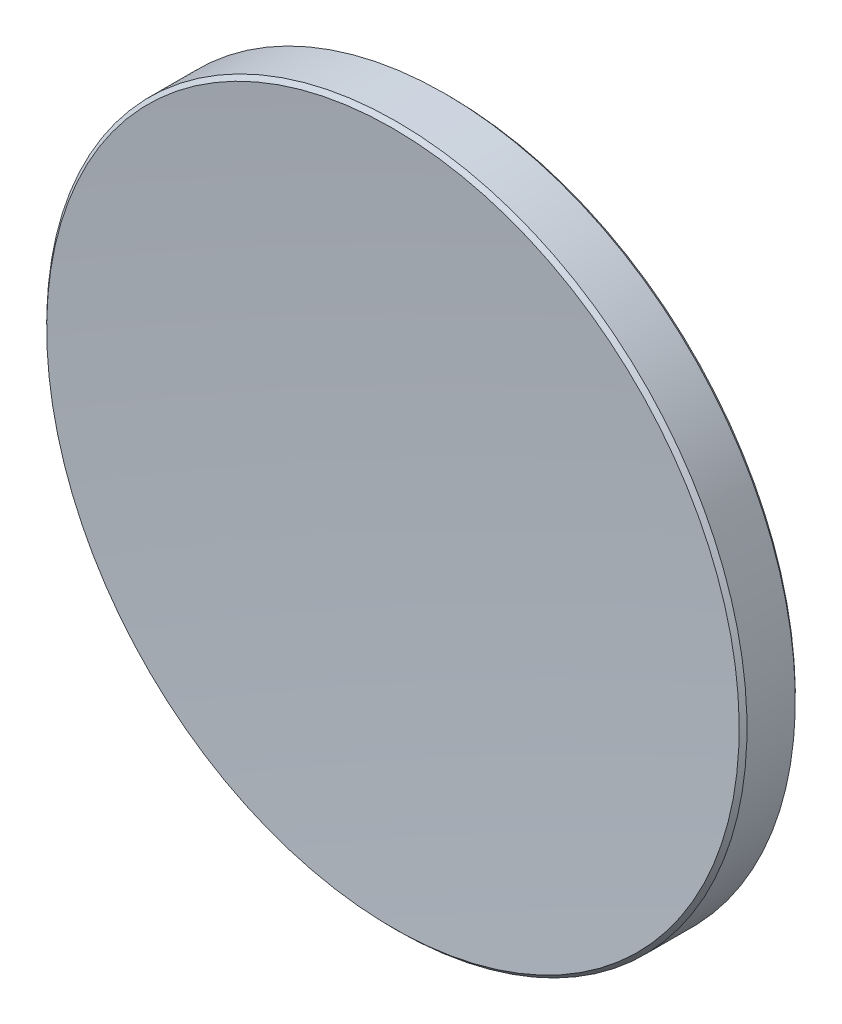
ISO-10303-21;
HEADER;
FILE_DESCRIPTION(('STEP AP214'),'2;1');
FILE_NAME('part.step','',(''),(''),'','','');
FILE_SCHEMA(('AUTOMOTIVE_DESIGN { 1 0 10303 214 1 1 1 1 }'));
ENDSEC;
DATA;
#1=APPLICATION_CONTEXT('core data for automotive mechanical design processes');
#2=APPLICATION_PROTOCOL_DEFINITION('international standard','automotive_design',2000,#1);
#3=PRODUCT_CONTEXT('',#1,'mechanical');
#4=PRODUCT('Part','Part','',(#3));
#5=PRODUCT_RELATED_PRODUCT_CATEGORY('part','',(#4));
#6=PRODUCT_DEFINITION_FORMATION('','',#4);
#7=PRODUCT_DEFINITION_CONTEXT('part definition',#1,'design');
#8=PRODUCT_DEFINITION('design','',#6,#7);
#9=PRODUCT_DEFINITION_SHAPE('','',#8);
#10=(LENGTH_UNIT() NAMED_UNIT(*) SI_UNIT(.MILLI.,.METRE.));
#11=(NAMED_UNIT(*) PLANE_ANGLE_UNIT() SI_UNIT($,.RADIAN.));
#12=(NAMED_UNIT(*) SI_UNIT($,.STERADIAN.) SOLID_ANGLE_UNIT());
#13=UNCERTAINTY_MEASURE_WITH_UNIT(LENGTH_MEASURE(1.E-05),#10,'distance_accuracy_value','');
#14=(GEOMETRIC_REPRESENTATION_CONTEXT(3) GLOBAL_UNCERTAINTY_ASSIGNED_CONTEXT((#13)) GLOBAL_UNIT_ASSIGNED_CONTEXT((#10,
#11,#12)) REPRESENTATION_CONTEXT('',''));
#15=CARTESIAN_POINT('',(0.,0.,0.));
#16=DIRECTION('',(0.,0.,1.));
#17=DIRECTION('',(1.,0.,0.));
#18=AXIS2_PLACEMENT_3D('',#15,#16,#17);
#19=CARTESIAN_POINT('',(0.,0.,211.25));
#20=DIRECTION('',(0.,0.,-1.));
#21=DIRECTION('',(0.,1.,0.));
#22=AXIS2_PLACEMENT_3D('',#19,#20,#21);
#23=SPHERICAL_SURFACE('',#22,209.8);
#24=CARTESIAN_POINT('',(0.,0.,1.82621409579944));
#25=DIRECTION('',(0.,0.,-1.));
#26=DIRECTION('',(0.,1.,0.));
#27=AXIS2_PLACEMENT_3D('',#24,#25,#26);
#28=CIRCLE('',#27,12.5585786437627);
#29=CARTESIAN_POINT('',(0.,12.5585786437627,1.82621409579944));
#30=VERTEX_POINT('',#29);
#31=EDGE_CURVE('E27',#30,#30,#28,.T.);
#32=ORIENTED_EDGE('',*,*,#31,.F.);
#33=EDGE_LOOP('',(#32));
#34=FACE_BOUND('',#33,.T.);
#35=ADVANCED_FACE('F13',(#34),#23,.F.);
#36=CARTESIAN_POINT('',(0.,0.,62.75));
#37=DIRECTION('',(0.,0.,-1.));
#38=DIRECTION('',(0.,1.,0.));
#39=AXIS2_PLACEMENT_3D('',#36,#37,#38);
#40=SPHERICAL_SURFACE('',#39,64.2);
#41=CARTESIAN_POINT('',(0.,0.,-0.209686327430417));
#42=DIRECTION('',(0.,0.,-1.));
#43=DIRECTION('',(0.,1.,0.));
#44=AXIS2_PLACEMENT_3D('',#41,#42,#43);
#45=CIRCLE('',#44,12.5585786437627);
#46=CARTESIAN_POINT('',(0.,12.5585786437627,-0.209686327430417));
#47=VERTEX_POINT('',#46);
#48=EDGE_CURVE('E9',#47,#47,#45,.T.);
#49=ORIENTED_EDGE('',*,*,#48,.T.);
#50=EDGE_LOOP('',(#49));
#51=FACE_BOUND('',#50,.T.);
#52=ADVANCED_FACE('F37',(#51),#40,.T.);
#53=CARTESIAN_POINT('',(0.,0.,-0.209686327430417));
#54=DIRECTION('',(0.,0.,1.));
#55=DIRECTION('',(0.,-1.,0.));
#56=AXIS2_PLACEMENT_3D('',#53,#54,#55);
#57=CONICAL_SURFACE('',#56,12.5585786437627,0.78539816339747);
#58=CARTESIAN_POINT('',(0.,0.,-0.0682649711931096));
#59=DIRECTION('',(0.,0.,-1.));
#60=DIRECTION('',(0.,1.,0.));
#61=AXIS2_PLACEMENT_3D('',#58,#59,#60);
#62=CIRCLE('',#61,12.7);
#63=CARTESIAN_POINT('',(0.,12.7,-0.0682649711931096));
#64=VERTEX_POINT('',#63);
#65=EDGE_CURVE('E19',#64,#64,#62,.T.);
#66=ORIENTED_EDGE('',*,*,#65,.T.);
#67=EDGE_LOOP('',(#66));
#68=FACE_BOUND('',#67,.T.);
#69=ORIENTED_EDGE('',*,*,#48,.F.);
#70=EDGE_LOOP('',(#69));
#71=FACE_BOUND('',#70,.T.);
#72=ADVANCED_FACE('F43',(#68,#71),#57,.T.);
#73=CARTESIAN_POINT('',(0.,0.,-1.45));
#74=DIRECTION('',(0.,0.,-1.));
#75=DIRECTION('',(0.,1.,0.));
#76=AXIS2_PLACEMENT_3D('',#73,#74,#75);
#77=CYLINDRICAL_SURFACE('',#76,12.7);
#78=CARTESIAN_POINT('',(0.,0.,1.68479273956216));
#79=DIRECTION('',(0.,0.,-1.));
#80=DIRECTION('',(0.,1.,0.));
#81=AXIS2_PLACEMENT_3D('',#78,#79,#80);
#82=CIRCLE('',#81,12.7);
#83=CARTESIAN_POINT('',(0.,12.7,1.68479273956216));
#84=VERTEX_POINT('',#83);
#85=EDGE_CURVE('E23',#84,#84,#82,.T.);
#86=ORIENTED_EDGE('',*,*,#85,.T.);
#87=EDGE_LOOP('',(#86));
#88=FACE_BOUND('',#87,.T.);
#89=ORIENTED_EDGE('',*,*,#65,.F.);
#90=EDGE_LOOP('',(#89));
#91=FACE_BOUND('',#90,.T.);
#92=ADVANCED_FACE('F48',(#88,#91),#77,.T.);
#93=CARTESIAN_POINT('',(0.,0.,1.68479273956216));
#94=DIRECTION('',(0.,0.,-1.));
#95=DIRECTION('',(0.,1.,0.));
#96=AXIS2_PLACEMENT_3D('',#93,#94,#95);
#97=CONICAL_SURFACE('',#96,12.7,0.78539816339753);
#98=ORIENTED_EDGE('',*,*,#31,.T.);
#99=EDGE_LOOP('',(#98));
#100=FACE_BOUND('',#99,.T.);
#101=ORIENTED_EDGE('',*,*,#85,.F.);
#102=EDGE_LOOP('',(#101));
#103=FACE_BOUND('',#102,.T.);
#104=ADVANCED_FACE('F33',(#100,#103),#97,.T.);
#105=CLOSED_SHELL('',(#35,#52,#72,#92,#104));
#106=MANIFOLD_SOLID_BREP('B1',#105);
#107=ADVANCED_BREP_SHAPE_REPRESENTATION('',(#18,#106),#14);
#108=SHAPE_DEFINITION_REPRESENTATION(#9,#107);
ENDSEC;
END-ISO-10303-21;
